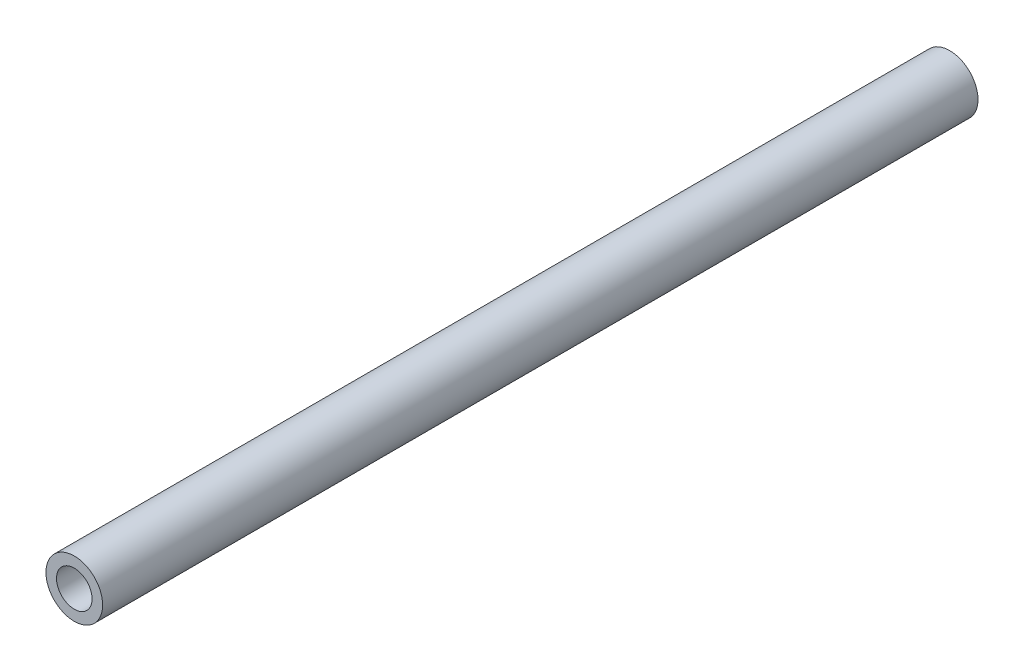
ISO-10303-21;
HEADER;
FILE_DESCRIPTION(('STEP AP214'),'2;1');
FILE_NAME('part.step','',(''),(''),'','','');
FILE_SCHEMA(('AUTOMOTIVE_DESIGN { 1 0 10303 214 1 1 1 1 }'));
ENDSEC;
DATA;
#1=APPLICATION_CONTEXT('core data for automotive mechanical design processes');
#2=APPLICATION_PROTOCOL_DEFINITION('international standard','automotive_design',2000,#1);
#3=PRODUCT_CONTEXT('',#1,'mechanical');
#4=PRODUCT('Part','Part','',(#3));
#5=PRODUCT_RELATED_PRODUCT_CATEGORY('part','',(#4));
#6=PRODUCT_DEFINITION_FORMATION('','',#4);
#7=PRODUCT_DEFINITION_CONTEXT('part definition',#1,'design');
#8=PRODUCT_DEFINITION('design','',#6,#7);
#9=PRODUCT_DEFINITION_SHAPE('','',#8);
#10=(LENGTH_UNIT() NAMED_UNIT(*) SI_UNIT(.MILLI.,.METRE.));
#11=(NAMED_UNIT(*) PLANE_ANGLE_UNIT() SI_UNIT($,.RADIAN.));
#12=(NAMED_UNIT(*) SI_UNIT($,.STERADIAN.) SOLID_ANGLE_UNIT());
#13=UNCERTAINTY_MEASURE_WITH_UNIT(LENGTH_MEASURE(1.E-05),#10,'distance_accuracy_value','');
#14=(GEOMETRIC_REPRESENTATION_CONTEXT(3) GLOBAL_UNCERTAINTY_ASSIGNED_CONTEXT((#13)) GLOBAL_UNIT_ASSIGNED_CONTEXT((#10,
#11,#12)) REPRESENTATION_CONTEXT('',''));
#15=CARTESIAN_POINT('',(0.,0.,0.));
#16=DIRECTION('',(0.,0.,1.));
#17=DIRECTION('',(1.,0.,0.));
#18=AXIS2_PLACEMENT_3D('',#15,#16,#17);
#19=CARTESIAN_POINT('',(0.,0.,200.));
#20=DIRECTION('',(0.,0.,-1.));
#21=DIRECTION('',(-1.,0.,0.));
#22=AXIS2_PLACEMENT_3D('',#19,#20,#21);
#23=CYLINDRICAL_SURFACE('',#22,6.475);
#24=CARTESIAN_POINT('',(0.,0.,200.));
#25=DIRECTION('',(0.,0.,1.));
#26=DIRECTION('',(1.,0.,0.));
#27=AXIS2_PLACEMENT_3D('',#24,#25,#26);
#28=CIRCLE('',#27,6.475);
#29=CARTESIAN_POINT('',(6.475,0.,200.));
#30=VERTEX_POINT('',#29);
#31=EDGE_CURVE('E10',#30,#30,#28,.T.);
#32=ORIENTED_EDGE('',*,*,#31,.F.);
#33=EDGE_LOOP('',(#32));
#34=FACE_BOUND('',#33,.T.);
#35=CARTESIAN_POINT('',(0.,0.,0.));
#36=DIRECTION('',(0.,0.,1.));
#37=DIRECTION('',(1.,0.,0.));
#38=AXIS2_PLACEMENT_3D('',#35,#36,#37);
#39=CIRCLE('',#38,6.475);
#40=CARTESIAN_POINT('',(6.475,0.,0.));
#41=VERTEX_POINT('',#40);
#42=EDGE_CURVE('E35',#41,#41,#39,.T.);
#43=ORIENTED_EDGE('',*,*,#42,.T.);
#44=EDGE_LOOP('',(#43));
#45=FACE_BOUND('',#44,.T.);
#46=ADVANCED_FACE('F32',(#34,#45),#23,.T.);
#47=CARTESIAN_POINT('',(0.,0.,200.));
#48=DIRECTION('',(0.,0.,1.));
#49=DIRECTION('',(1.,0.,0.));
#50=AXIS2_PLACEMENT_3D('',#47,#48,#49);
#51=PLANE('',#50);
#52=CARTESIAN_POINT('',(0.,0.,200.));
#53=DIRECTION('',(0.,0.,-1.));
#54=DIRECTION('',(-1.,0.,0.));
#55=AXIS2_PLACEMENT_3D('',#52,#53,#54);
#56=CIRCLE('',#55,4.065);
#57=CARTESIAN_POINT('',(-4.065,0.,200.));
#58=VERTEX_POINT('',#57);
#59=EDGE_CURVE('E42',#58,#58,#56,.T.);
#60=ORIENTED_EDGE('',*,*,#59,.T.);
#61=EDGE_LOOP('',(#60));
#62=FACE_BOUND('',#61,.T.);
#63=ORIENTED_EDGE('',*,*,#31,.T.);
#64=EDGE_LOOP('',(#63));
#65=FACE_BOUND('',#64,.T.);
#66=ADVANCED_FACE('F50',(#62,#65),#51,.T.);
#67=CARTESIAN_POINT('',(0.,0.,0.));
#68=DIRECTION('',(0.,0.,1.));
#69=DIRECTION('',(1.,0.,0.));
#70=AXIS2_PLACEMENT_3D('',#67,#68,#69);
#71=PLANE('',#70);
#72=CARTESIAN_POINT('',(0.,0.,0.));
#73=DIRECTION('',(0.,0.,-1.));
#74=DIRECTION('',(-1.,0.,0.));
#75=AXIS2_PLACEMENT_3D('',#72,#73,#74);
#76=CIRCLE('',#75,4.065);
#77=CARTESIAN_POINT('',(-4.065,0.,0.));
#78=VERTEX_POINT('',#77);
#79=EDGE_CURVE('E44',#78,#78,#76,.T.);
#80=ORIENTED_EDGE('',*,*,#79,.F.);
#81=EDGE_LOOP('',(#80));
#82=FACE_BOUND('',#81,.T.);
#83=ORIENTED_EDGE('',*,*,#42,.F.);
#84=EDGE_LOOP('',(#83));
#85=FACE_BOUND('',#84,.T.);
#86=ADVANCED_FACE('F55',(#82,#85),#71,.F.);
#87=CARTESIAN_POINT('',(0.,0.,200.));
#88=DIRECTION('',(0.,0.,-1.));
#89=DIRECTION('',(-1.,0.,0.));
#90=AXIS2_PLACEMENT_3D('',#87,#88,#89);
#91=CYLINDRICAL_SURFACE('',#90,4.065);
#92=ORIENTED_EDGE('',*,*,#59,.F.);
#93=EDGE_LOOP('',(#92));
#94=FACE_BOUND('',#93,.T.);
#95=ORIENTED_EDGE('',*,*,#79,.T.);
#96=EDGE_LOOP('',(#95));
#97=FACE_BOUND('',#96,.T.);
#98=ADVANCED_FACE('F52',(#94,#97),#91,.F.);
#99=CLOSED_SHELL('',(#46,#66,#86,#98));
#100=MANIFOLD_SOLID_BREP('B2',#99);
#101=ADVANCED_BREP_SHAPE_REPRESENTATION('',(#18,#100),#14);
#102=SHAPE_DEFINITION_REPRESENTATION(#9,#101);
ENDSEC;
END-ISO-10303-21;
